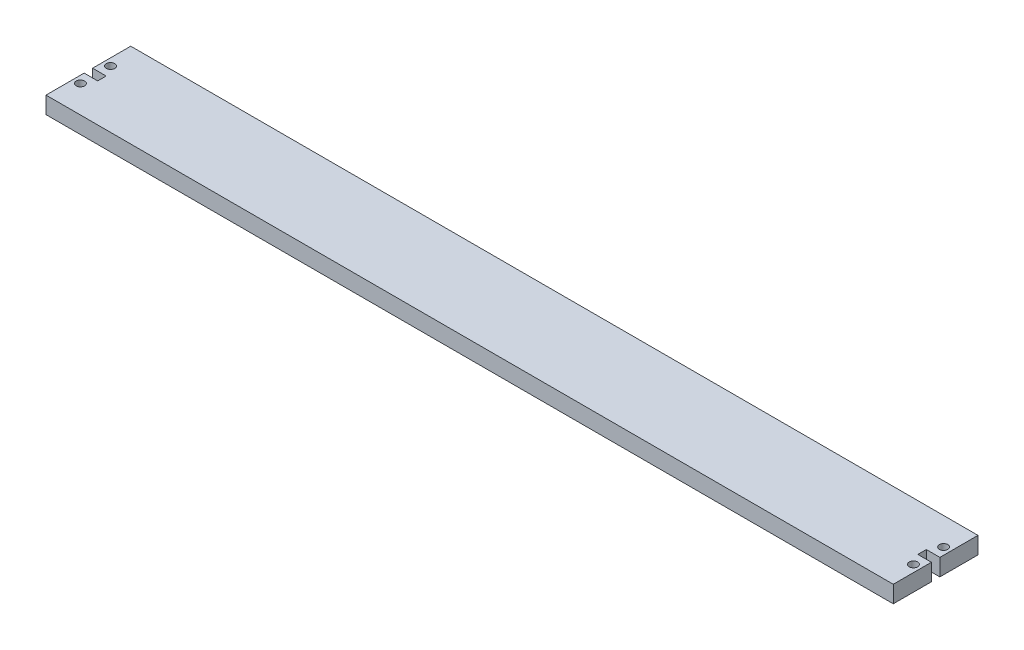
ISO-10303-21;
HEADER;
FILE_DESCRIPTION(('STEP AP214'),'2;1');
FILE_NAME('part.step','',(''),(''),'','','');
FILE_SCHEMA(('AUTOMOTIVE_DESIGN { 1 0 10303 214 1 1 1 1 }'));
ENDSEC;
DATA;
#1=APPLICATION_CONTEXT('core data for automotive mechanical design processes');
#2=APPLICATION_PROTOCOL_DEFINITION('international standard','automotive_design',2000,#1);
#3=PRODUCT_CONTEXT('',#1,'mechanical');
#4=PRODUCT('Part','Part','',(#3));
#5=PRODUCT_RELATED_PRODUCT_CATEGORY('part','',(#4));
#6=PRODUCT_DEFINITION_FORMATION('','',#4);
#7=PRODUCT_DEFINITION_CONTEXT('part definition',#1,'design');
#8=PRODUCT_DEFINITION('design','',#6,#7);
#9=PRODUCT_DEFINITION_SHAPE('','',#8);
#10=(LENGTH_UNIT() NAMED_UNIT(*) SI_UNIT(.MILLI.,.METRE.));
#11=(NAMED_UNIT(*) PLANE_ANGLE_UNIT() SI_UNIT($,.RADIAN.));
#12=(NAMED_UNIT(*) SI_UNIT($,.STERADIAN.) SOLID_ANGLE_UNIT());
#13=UNCERTAINTY_MEASURE_WITH_UNIT(LENGTH_MEASURE(1.E-05),#10,'distance_accuracy_value','');
#14=(GEOMETRIC_REPRESENTATION_CONTEXT(3) GLOBAL_UNCERTAINTY_ASSIGNED_CONTEXT((#13)) GLOBAL_UNIT_ASSIGNED_CONTEXT((#10,
#11,#12)) REPRESENTATION_CONTEXT('',''));
#15=CARTESIAN_POINT('',(0.,0.,0.));
#16=DIRECTION('',(0.,0.,1.));
#17=DIRECTION('',(1.,0.,0.));
#18=AXIS2_PLACEMENT_3D('',#15,#16,#17);
#19=CARTESIAN_POINT('',(500.,10.,0.));
#20=DIRECTION('',(-1.,0.,0.));
#21=DIRECTION('',(0.,0.,1.));
#22=AXIS2_PLACEMENT_3D('',#19,#20,#21);
#23=PLANE('',#22);
#24=DIRECTION('',(0.,0.,-1.));
#25=VECTOR('',#24,1.);
#26=CARTESIAN_POINT('',(500.,0.,0.));
#27=LINE('',#26,#25);
#28=CARTESIAN_POINT('',(500.,0.,50.));
#29=VERTEX_POINT('',#28);
#30=CARTESIAN_POINT('',(500.,0.,27.5));
#31=VERTEX_POINT('',#30);
#32=EDGE_CURVE('E139',#29,#31,#27,.T.);
#33=ORIENTED_EDGE('',*,*,#32,.T.);
#34=DIRECTION('',(0.,1.,0.));
#35=VECTOR('',#34,1.);
#36=CARTESIAN_POINT('',(500.,0.,27.5));
#37=LINE('',#36,#35);
#38=CARTESIAN_POINT('',(500.,10.,27.5));
#39=VERTEX_POINT('',#38);
#40=EDGE_CURVE('E123',#31,#39,#37,.T.);
#41=ORIENTED_EDGE('',*,*,#40,.T.);
#42=DIRECTION('',(0.,0.,-1.));
#43=VECTOR('',#42,1.);
#44=CARTESIAN_POINT('',(500.,10.,0.));
#45=LINE('',#44,#43);
#46=CARTESIAN_POINT('',(500.,10.,50.));
#47=VERTEX_POINT('',#46);
#48=EDGE_CURVE('E182',#47,#39,#45,.T.);
#49=ORIENTED_EDGE('',*,*,#48,.F.);
#50=DIRECTION('',(0.,-1.,0.));
#51=VECTOR('',#50,1.);
#52=CARTESIAN_POINT('',(500.,10.,50.));
#53=LINE('',#52,#51);
#54=EDGE_CURVE('E42',#47,#29,#53,.T.);
#55=ORIENTED_EDGE('',*,*,#54,.T.);
#56=EDGE_LOOP('',(#33,#41,#49,#55));
#57=FACE_BOUND('',#56,.T.);
#58=ADVANCED_FACE('F34',(#57),#23,.F.);
#59=CARTESIAN_POINT('',(0.,10.,0.));
#60=DIRECTION('',(1.,0.,0.));
#61=DIRECTION('',(0.,0.,-1.));
#62=AXIS2_PLACEMENT_3D('',#59,#60,#61);
#63=PLANE('',#62);
#64=DIRECTION('',(0.,0.,1.));
#65=VECTOR('',#64,1.);
#66=CARTESIAN_POINT('',(0.,0.,0.));
#67=LINE('',#66,#65);
#68=CARTESIAN_POINT('',(0.,0.,0.));
#69=VERTEX_POINT('',#68);
#70=CARTESIAN_POINT('',(0.,0.,22.5));
#71=VERTEX_POINT('',#70);
#72=EDGE_CURVE('E173',#69,#71,#67,.T.);
#73=ORIENTED_EDGE('',*,*,#72,.T.);
#74=DIRECTION('',(0.,1.,0.));
#75=VECTOR('',#74,1.);
#76=CARTESIAN_POINT('',(0.,0.,22.5));
#77=LINE('',#76,#75);
#78=CARTESIAN_POINT('',(0.,10.,22.5));
#79=VERTEX_POINT('',#78);
#80=EDGE_CURVE('E193',#71,#79,#77,.T.);
#81=ORIENTED_EDGE('',*,*,#80,.T.);
#82=DIRECTION('',(0.,0.,1.));
#83=VECTOR('',#82,1.);
#84=CARTESIAN_POINT('',(0.,10.,0.));
#85=LINE('',#84,#83);
#86=CARTESIAN_POINT('',(0.,10.,0.));
#87=VERTEX_POINT('',#86);
#88=EDGE_CURVE('E187',#87,#79,#85,.T.);
#89=ORIENTED_EDGE('',*,*,#88,.F.);
#90=DIRECTION('',(0.,-1.,0.));
#91=VECTOR('',#90,1.);
#92=CARTESIAN_POINT('',(0.,10.,0.));
#93=LINE('',#92,#91);
#94=EDGE_CURVE('E155',#87,#69,#93,.T.);
#95=ORIENTED_EDGE('',*,*,#94,.T.);
#96=EDGE_LOOP('',(#73,#81,#89,#95));
#97=FACE_BOUND('',#96,.T.);
#98=ADVANCED_FACE('F266',(#97),#63,.F.);
#99=CARTESIAN_POINT('',(0.,10.,27.5));
#100=VERTEX_POINT('',#99);
#101=CARTESIAN_POINT('',(0.,10.,50.));
#102=VERTEX_POINT('',#101);
#103=EDGE_CURVE('E149',#100,#102,#85,.T.);
#104=ORIENTED_EDGE('',*,*,#103,.F.);
#105=DIRECTION('',(0.,1.,0.));
#106=VECTOR('',#105,1.);
#107=CARTESIAN_POINT('',(0.,0.,27.5));
#108=LINE('',#107,#106);
#109=CARTESIAN_POINT('',(0.,0.,27.5));
#110=VERTEX_POINT('',#109);
#111=EDGE_CURVE('E196',#110,#100,#108,.T.);
#112=ORIENTED_EDGE('',*,*,#111,.F.);
#113=CARTESIAN_POINT('',(0.,0.,50.));
#114=VERTEX_POINT('',#113);
#115=EDGE_CURVE('E178',#110,#114,#67,.T.);
#116=ORIENTED_EDGE('',*,*,#115,.T.);
#117=DIRECTION('',(0.,-1.,0.));
#118=VECTOR('',#117,1.);
#119=CARTESIAN_POINT('',(0.,10.,50.));
#120=LINE('',#119,#118);
#121=EDGE_CURVE('E11',#102,#114,#120,.T.);
#122=ORIENTED_EDGE('',*,*,#121,.F.);
#123=EDGE_LOOP('',(#104,#112,#116,#122));
#124=FACE_BOUND('',#123,.T.);
#125=ADVANCED_FACE('F36',(#124),#63,.F.);
#126=CARTESIAN_POINT('',(0.,10.,50.));
#127=DIRECTION('',(0.,0.,-1.));
#128=DIRECTION('',(-1.,0.,0.));
#129=AXIS2_PLACEMENT_3D('',#126,#127,#128);
#130=PLANE('',#129);
#131=DIRECTION('',(1.,0.,0.));
#132=VECTOR('',#131,1.);
#133=CARTESIAN_POINT('',(0.,0.,50.));
#134=LINE('',#133,#132);
#135=EDGE_CURVE('E151',#114,#29,#134,.T.);
#136=ORIENTED_EDGE('',*,*,#135,.T.);
#137=ORIENTED_EDGE('',*,*,#54,.F.);
#138=DIRECTION('',(1.,0.,0.));
#139=VECTOR('',#138,1.);
#140=CARTESIAN_POINT('',(0.,10.,50.));
#141=LINE('',#140,#139);
#142=EDGE_CURVE('E185',#102,#47,#141,.T.);
#143=ORIENTED_EDGE('',*,*,#142,.F.);
#144=ORIENTED_EDGE('',*,*,#121,.T.);
#145=EDGE_LOOP('',(#136,#137,#143,#144));
#146=FACE_BOUND('',#145,.T.);
#147=ADVANCED_FACE('F273',(#146),#130,.F.);
#148=CARTESIAN_POINT('',(500.,10.,22.5));
#149=VERTEX_POINT('',#148);
#150=CARTESIAN_POINT('',(500.,10.,0.));
#151=VERTEX_POINT('',#150);
#152=EDGE_CURVE('E184',#149,#151,#45,.T.);
#153=ORIENTED_EDGE('',*,*,#152,.F.);
#154=DIRECTION('',(0.,1.,0.));
#155=VECTOR('',#154,1.);
#156=CARTESIAN_POINT('',(500.,0.,22.5));
#157=LINE('',#156,#155);
#158=CARTESIAN_POINT('',(500.,0.,22.5));
#159=VERTEX_POINT('',#158);
#160=EDGE_CURVE('E133',#159,#149,#157,.T.);
#161=ORIENTED_EDGE('',*,*,#160,.F.);
#162=CARTESIAN_POINT('',(500.,0.,0.));
#163=VERTEX_POINT('',#162);
#164=EDGE_CURVE('E147',#159,#163,#27,.T.);
#165=ORIENTED_EDGE('',*,*,#164,.T.);
#166=DIRECTION('',(0.,-1.,0.));
#167=VECTOR('',#166,1.);
#168=CARTESIAN_POINT('',(500.,10.,0.));
#169=LINE('',#168,#167);
#170=EDGE_CURVE('E158',#151,#163,#169,.T.);
#171=ORIENTED_EDGE('',*,*,#170,.F.);
#172=EDGE_LOOP('',(#153,#161,#165,#171));
#173=FACE_BOUND('',#172,.T.);
#174=ADVANCED_FACE('F250',(#173),#23,.F.);
#175=CARTESIAN_POINT('',(0.,10.,0.));
#176=DIRECTION('',(0.,0.,1.));
#177=DIRECTION('',(1.,0.,0.));
#178=AXIS2_PLACEMENT_3D('',#175,#176,#177);
#179=PLANE('',#178);
#180=DIRECTION('',(-1.,0.,0.));
#181=VECTOR('',#180,1.);
#182=CARTESIAN_POINT('',(0.,0.,0.));
#183=LINE('',#182,#181);
#184=EDGE_CURVE('E146',#163,#69,#183,.T.);
#185=ORIENTED_EDGE('',*,*,#184,.T.);
#186=ORIENTED_EDGE('',*,*,#94,.F.);
#187=DIRECTION('',(-1.,0.,0.));
#188=VECTOR('',#187,1.);
#189=CARTESIAN_POINT('',(0.,10.,0.));
#190=LINE('',#189,#188);
#191=EDGE_CURVE('E159',#151,#87,#190,.T.);
#192=ORIENTED_EDGE('',*,*,#191,.F.);
#193=ORIENTED_EDGE('',*,*,#170,.T.);
#194=EDGE_LOOP('',(#185,#186,#192,#193));
#195=FACE_BOUND('',#194,.T.);
#196=ADVANCED_FACE('F165',(#195),#179,.F.);
#197=CARTESIAN_POINT('',(0.,10.,0.));
#198=DIRECTION('',(0.,1.,0.));
#199=DIRECTION('',(0.,0.,1.));
#200=AXIS2_PLACEMENT_3D('',#197,#198,#199);
#201=PLANE('',#200);
#202=DIRECTION('',(1.,0.,0.));
#203=VECTOR('',#202,1.);
#204=CARTESIAN_POINT('',(492.,10.,27.5));
#205=LINE('',#204,#203);
#206=CARTESIAN_POINT('',(492.,10.,27.5));
#207=VERTEX_POINT('',#206);
#208=EDGE_CURVE('E128',#207,#39,#205,.T.);
#209=ORIENTED_EDGE('',*,*,#208,.F.);
#210=DIRECTION('',(0.,0.,1.));
#211=VECTOR('',#210,1.);
#212=CARTESIAN_POINT('',(492.,10.,22.5));
#213=LINE('',#212,#211);
#214=CARTESIAN_POINT('',(492.,10.,22.5));
#215=VERTEX_POINT('',#214);
#216=EDGE_CURVE('E142',#215,#207,#213,.T.);
#217=ORIENTED_EDGE('',*,*,#216,.F.);
#218=DIRECTION('',(-1.,0.,0.));
#219=VECTOR('',#218,1.);
#220=CARTESIAN_POINT('',(500.,10.,22.5));
#221=LINE('',#220,#219);
#222=EDGE_CURVE('E241',#149,#215,#221,.T.);
#223=ORIENTED_EDGE('',*,*,#222,.F.);
#224=ORIENTED_EDGE('',*,*,#152,.T.);
#225=ORIENTED_EDGE('',*,*,#191,.T.);
#226=ORIENTED_EDGE('',*,*,#88,.T.);
#227=DIRECTION('',(-1.,0.,0.));
#228=VECTOR('',#227,1.);
#229=CARTESIAN_POINT('',(0.,10.,22.5));
#230=LINE('',#229,#228);
#231=CARTESIAN_POINT('',(8.,10.,22.5));
#232=VERTEX_POINT('',#231);
#233=EDGE_CURVE('E203',#232,#79,#230,.T.);
#234=ORIENTED_EDGE('',*,*,#233,.F.);
#235=DIRECTION('',(0.,0.,-1.));
#236=VECTOR('',#235,1.);
#237=CARTESIAN_POINT('',(8.,10.,22.5));
#238=LINE('',#237,#236);
#239=CARTESIAN_POINT('',(8.,10.,27.5));
#240=VERTEX_POINT('',#239);
#241=EDGE_CURVE('E206',#240,#232,#238,.T.);
#242=ORIENTED_EDGE('',*,*,#241,.F.);
#243=DIRECTION('',(1.,0.,0.));
#244=VECTOR('',#243,1.);
#245=CARTESIAN_POINT('',(8.,10.,27.5));
#246=LINE('',#245,#244);
#247=EDGE_CURVE('E209',#100,#240,#246,.T.);
#248=ORIENTED_EDGE('',*,*,#247,.F.);
#249=ORIENTED_EDGE('',*,*,#103,.T.);
#250=ORIENTED_EDGE('',*,*,#142,.T.);
#251=ORIENTED_EDGE('',*,*,#48,.T.);
#252=EDGE_LOOP('',(#209,#217,#223,#224,#225,#226,#234,#242,#248,#249,#250,#251));
#253=FACE_BOUND('',#252,.T.);
#254=CARTESIAN_POINT('',(495.8,10.,16.1));
#255=DIRECTION('',(0.,1.,0.));
#256=DIRECTION('',(0.,0.,-1.));
#257=AXIS2_PLACEMENT_3D('',#254,#255,#256);
#258=CIRCLE('',#257,2.49999999999997);
#259=CARTESIAN_POINT('',(495.8,10.,13.6));
#260=VERTEX_POINT('',#259);
#261=EDGE_CURVE('E229',#260,#260,#258,.T.);
#262=ORIENTED_EDGE('',*,*,#261,.F.);
#263=EDGE_LOOP('',(#262));
#264=FACE_BOUND('',#263,.T.);
#265=CARTESIAN_POINT('',(495.8,10.,33.9));
#266=DIRECTION('',(0.,1.,0.));
#267=DIRECTION('',(0.,0.,1.));
#268=AXIS2_PLACEMENT_3D('',#265,#266,#267);
#269=CIRCLE('',#268,2.49999999999997);
#270=CARTESIAN_POINT('',(495.8,10.,36.4));
#271=VERTEX_POINT('',#270);
#272=EDGE_CURVE('E223',#271,#271,#269,.T.);
#273=ORIENTED_EDGE('',*,*,#272,.F.);
#274=EDGE_LOOP('',(#273));
#275=FACE_BOUND('',#274,.T.);
#276=CARTESIAN_POINT('',(4.2,10.,33.9));
#277=DIRECTION('',(0.,1.,0.));
#278=DIRECTION('',(0.,0.,-1.));
#279=AXIS2_PLACEMENT_3D('',#276,#277,#278);
#280=CIRCLE('',#279,2.5);
#281=CARTESIAN_POINT('',(4.2,10.,31.4));
#282=VERTEX_POINT('',#281);
#283=EDGE_CURVE('E217',#282,#282,#280,.T.);
#284=ORIENTED_EDGE('',*,*,#283,.F.);
#285=EDGE_LOOP('',(#284));
#286=FACE_BOUND('',#285,.T.);
#287=CARTESIAN_POINT('',(4.2,10.,16.1));
#288=DIRECTION('',(0.,1.,0.));
#289=DIRECTION('',(0.,0.,1.));
#290=AXIS2_PLACEMENT_3D('',#287,#288,#289);
#291=CIRCLE('',#290,2.5);
#292=CARTESIAN_POINT('',(4.2,10.,18.6));
#293=VERTEX_POINT('',#292);
#294=EDGE_CURVE('E190',#293,#293,#291,.T.);
#295=ORIENTED_EDGE('',*,*,#294,.F.);
#296=EDGE_LOOP('',(#295));
#297=FACE_BOUND('',#296,.T.);
#298=ADVANCED_FACE('F252',(#253,#264,#275,#286,#297),#201,.T.);
#299=CARTESIAN_POINT('',(0.,0.,0.));
#300=DIRECTION('',(0.,1.,0.));
#301=DIRECTION('',(0.,0.,1.));
#302=AXIS2_PLACEMENT_3D('',#299,#300,#301);
#303=PLANE('',#302);
#304=CARTESIAN_POINT('',(495.8,0.,16.1));
#305=DIRECTION('',(0.,1.,0.));
#306=DIRECTION('',(0.,0.,-1.));
#307=AXIS2_PLACEMENT_3D('',#304,#305,#306);
#308=CIRCLE('',#307,2.49999999999997);
#309=CARTESIAN_POINT('',(495.8,0.,13.6));
#310=VERTEX_POINT('',#309);
#311=EDGE_CURVE('E226',#310,#310,#308,.T.);
#312=ORIENTED_EDGE('',*,*,#311,.T.);
#313=EDGE_LOOP('',(#312));
#314=FACE_BOUND('',#313,.T.);
#315=CARTESIAN_POINT('',(495.8,0.,33.9));
#316=DIRECTION('',(0.,1.,0.));
#317=DIRECTION('',(0.,0.,1.));
#318=AXIS2_PLACEMENT_3D('',#315,#316,#317);
#319=CIRCLE('',#318,2.49999999999997);
#320=CARTESIAN_POINT('',(495.8,0.,36.4));
#321=VERTEX_POINT('',#320);
#322=EDGE_CURVE('E220',#321,#321,#319,.T.);
#323=ORIENTED_EDGE('',*,*,#322,.T.);
#324=EDGE_LOOP('',(#323));
#325=FACE_BOUND('',#324,.T.);
#326=CARTESIAN_POINT('',(4.2,0.,33.9));
#327=DIRECTION('',(0.,1.,0.));
#328=DIRECTION('',(0.,0.,-1.));
#329=AXIS2_PLACEMENT_3D('',#326,#327,#328);
#330=CIRCLE('',#329,2.5);
#331=CARTESIAN_POINT('',(4.2,0.,31.4));
#332=VERTEX_POINT('',#331);
#333=EDGE_CURVE('E212',#332,#332,#330,.T.);
#334=ORIENTED_EDGE('',*,*,#333,.T.);
#335=EDGE_LOOP('',(#334));
#336=FACE_BOUND('',#335,.T.);
#337=CARTESIAN_POINT('',(4.2,0.,16.1));
#338=DIRECTION('',(0.,1.,0.));
#339=DIRECTION('',(0.,0.,1.));
#340=AXIS2_PLACEMENT_3D('',#337,#338,#339);
#341=CIRCLE('',#340,2.5);
#342=CARTESIAN_POINT('',(4.2,0.,18.6));
#343=VERTEX_POINT('',#342);
#344=EDGE_CURVE('E179',#343,#343,#341,.T.);
#345=ORIENTED_EDGE('',*,*,#344,.T.);
#346=EDGE_LOOP('',(#345));
#347=FACE_BOUND('',#346,.T.);
#348=DIRECTION('',(0.,0.,1.));
#349=VECTOR('',#348,1.);
#350=CARTESIAN_POINT('',(492.,0.,22.5));
#351=LINE('',#350,#349);
#352=CARTESIAN_POINT('',(492.,0.,22.5));
#353=VERTEX_POINT('',#352);
#354=CARTESIAN_POINT('',(492.,0.,27.5));
#355=VERTEX_POINT('',#354);
#356=EDGE_CURVE('E49',#353,#355,#351,.T.);
#357=ORIENTED_EDGE('',*,*,#356,.T.);
#358=DIRECTION('',(1.,0.,0.));
#359=VECTOR('',#358,1.);
#360=CARTESIAN_POINT('',(492.,0.,27.5));
#361=LINE('',#360,#359);
#362=EDGE_CURVE('E126',#355,#31,#361,.T.);
#363=ORIENTED_EDGE('',*,*,#362,.T.);
#364=ORIENTED_EDGE('',*,*,#32,.F.);
#365=ORIENTED_EDGE('',*,*,#135,.F.);
#366=ORIENTED_EDGE('',*,*,#115,.F.);
#367=DIRECTION('',(1.,0.,0.));
#368=VECTOR('',#367,1.);
#369=CARTESIAN_POINT('',(8.,0.,27.5));
#370=LINE('',#369,#368);
#371=CARTESIAN_POINT('',(8.,0.,27.5));
#372=VERTEX_POINT('',#371);
#373=EDGE_CURVE('E205',#110,#372,#370,.T.);
#374=ORIENTED_EDGE('',*,*,#373,.T.);
#375=DIRECTION('',(0.,0.,-1.));
#376=VECTOR('',#375,1.);
#377=CARTESIAN_POINT('',(8.,0.,22.5));
#378=LINE('',#377,#376);
#379=CARTESIAN_POINT('',(8.,0.,22.5));
#380=VERTEX_POINT('',#379);
#381=EDGE_CURVE('E57',#372,#380,#378,.T.);
#382=ORIENTED_EDGE('',*,*,#381,.T.);
#383=DIRECTION('',(-1.,0.,0.));
#384=VECTOR('',#383,1.);
#385=CARTESIAN_POINT('',(0.,0.,22.5));
#386=LINE('',#385,#384);
#387=EDGE_CURVE('E175',#380,#71,#386,.T.);
#388=ORIENTED_EDGE('',*,*,#387,.T.);
#389=ORIENTED_EDGE('',*,*,#72,.F.);
#390=ORIENTED_EDGE('',*,*,#184,.F.);
#391=ORIENTED_EDGE('',*,*,#164,.F.);
#392=DIRECTION('',(-1.,0.,0.));
#393=VECTOR('',#392,1.);
#394=CARTESIAN_POINT('',(500.,0.,22.5));
#395=LINE('',#394,#393);
#396=EDGE_CURVE('E141',#159,#353,#395,.T.);
#397=ORIENTED_EDGE('',*,*,#396,.T.);
#398=EDGE_LOOP('',(#357,#363,#364,#365,#366,#374,#382,#388,#389,#390,#391,#397));
#399=FACE_BOUND('',#398,.T.);
#400=ADVANCED_FACE('F137',(#314,#325,#336,#347,#399),#303,.F.);
#401=CARTESIAN_POINT('',(4.2,0.,16.1));
#402=DIRECTION('',(0.,1.,0.));
#403=DIRECTION('',(0.,0.,1.));
#404=AXIS2_PLACEMENT_3D('',#401,#402,#403);
#405=CYLINDRICAL_SURFACE('',#404,2.5);
#406=ORIENTED_EDGE('',*,*,#344,.F.);
#407=EDGE_LOOP('',(#406));
#408=FACE_BOUND('',#407,.T.);
#409=ORIENTED_EDGE('',*,*,#294,.T.);
#410=EDGE_LOOP('',(#409));
#411=FACE_BOUND('',#410,.T.);
#412=ADVANCED_FACE('F298',(#408,#411),#405,.F.);
#413=CARTESIAN_POINT('',(0.,0.,22.5));
#414=DIRECTION('',(0.,0.,-1.));
#415=DIRECTION('',(-1.,0.,0.));
#416=AXIS2_PLACEMENT_3D('',#413,#414,#415);
#417=PLANE('',#416);
#418=ORIENTED_EDGE('',*,*,#233,.T.);
#419=ORIENTED_EDGE('',*,*,#80,.F.);
#420=ORIENTED_EDGE('',*,*,#387,.F.);
#421=DIRECTION('',(0.,1.,0.));
#422=VECTOR('',#421,1.);
#423=CARTESIAN_POINT('',(8.,0.,22.5));
#424=LINE('',#423,#422);
#425=EDGE_CURVE('E200',#380,#232,#424,.T.);
#426=ORIENTED_EDGE('',*,*,#425,.T.);
#427=EDGE_LOOP('',(#418,#419,#420,#426));
#428=FACE_BOUND('',#427,.T.);
#429=ADVANCED_FACE('F295',(#428),#417,.F.);
#430=CARTESIAN_POINT('',(8.,0.,22.5));
#431=DIRECTION('',(1.,0.,0.));
#432=DIRECTION('',(0.,0.,-1.));
#433=AXIS2_PLACEMENT_3D('',#430,#431,#432);
#434=PLANE('',#433);
#435=ORIENTED_EDGE('',*,*,#241,.T.);
#436=ORIENTED_EDGE('',*,*,#425,.F.);
#437=ORIENTED_EDGE('',*,*,#381,.F.);
#438=DIRECTION('',(0.,1.,0.));
#439=VECTOR('',#438,1.);
#440=CARTESIAN_POINT('',(8.,0.,27.5));
#441=LINE('',#440,#439);
#442=EDGE_CURVE('E198',#372,#240,#441,.T.);
#443=ORIENTED_EDGE('',*,*,#442,.T.);
#444=EDGE_LOOP('',(#435,#436,#437,#443));
#445=FACE_BOUND('',#444,.T.);
#446=ADVANCED_FACE('F293',(#445),#434,.F.);
#447=CARTESIAN_POINT('',(8.,0.,27.5));
#448=DIRECTION('',(0.,0.,1.));
#449=DIRECTION('',(1.,0.,0.));
#450=AXIS2_PLACEMENT_3D('',#447,#448,#449);
#451=PLANE('',#450);
#452=ORIENTED_EDGE('',*,*,#247,.T.);
#453=ORIENTED_EDGE('',*,*,#442,.F.);
#454=ORIENTED_EDGE('',*,*,#373,.F.);
#455=ORIENTED_EDGE('',*,*,#111,.T.);
#456=EDGE_LOOP('',(#452,#453,#454,#455));
#457=FACE_BOUND('',#456,.T.);
#458=ADVANCED_FACE('F290',(#457),#451,.F.);
#459=CARTESIAN_POINT('',(4.2,0.,33.9));
#460=DIRECTION('',(0.,1.,0.));
#461=DIRECTION('',(0.,0.,1.));
#462=AXIS2_PLACEMENT_3D('',#459,#460,#461);
#463=CYLINDRICAL_SURFACE('',#462,2.5);
#464=ORIENTED_EDGE('',*,*,#333,.F.);
#465=EDGE_LOOP('',(#464));
#466=FACE_BOUND('',#465,.T.);
#467=ORIENTED_EDGE('',*,*,#283,.T.);
#468=EDGE_LOOP('',(#467));
#469=FACE_BOUND('',#468,.T.);
#470=ADVANCED_FACE('F308',(#466,#469),#463,.F.);
#471=CARTESIAN_POINT('',(495.8,0.,33.9));
#472=DIRECTION('',(0.,1.,0.));
#473=DIRECTION('',(0.,0.,1.));
#474=AXIS2_PLACEMENT_3D('',#471,#472,#473);
#475=CYLINDRICAL_SURFACE('',#474,2.49999999999997);
#476=ORIENTED_EDGE('',*,*,#322,.F.);
#477=EDGE_LOOP('',(#476));
#478=FACE_BOUND('',#477,.T.);
#479=ORIENTED_EDGE('',*,*,#272,.T.);
#480=EDGE_LOOP('',(#479));
#481=FACE_BOUND('',#480,.T.);
#482=ADVANCED_FACE('F332',(#478,#481),#475,.F.);
#483=CARTESIAN_POINT('',(495.8,0.,16.1));
#484=DIRECTION('',(0.,1.,0.));
#485=DIRECTION('',(0.,0.,1.));
#486=AXIS2_PLACEMENT_3D('',#483,#484,#485);
#487=CYLINDRICAL_SURFACE('',#486,2.49999999999997);
#488=ORIENTED_EDGE('',*,*,#311,.F.);
#489=EDGE_LOOP('',(#488));
#490=FACE_BOUND('',#489,.T.);
#491=ORIENTED_EDGE('',*,*,#261,.T.);
#492=EDGE_LOOP('',(#491));
#493=FACE_BOUND('',#492,.T.);
#494=ADVANCED_FACE('F263',(#490,#493),#487,.F.);
#495=CARTESIAN_POINT('',(492.,0.,27.5));
#496=DIRECTION('',(0.,0.,1.));
#497=DIRECTION('',(1.,0.,0.));
#498=AXIS2_PLACEMENT_3D('',#495,#496,#497);
#499=PLANE('',#498);
#500=ORIENTED_EDGE('',*,*,#208,.T.);
#501=ORIENTED_EDGE('',*,*,#40,.F.);
#502=ORIENTED_EDGE('',*,*,#362,.F.);
#503=DIRECTION('',(0.,1.,0.));
#504=VECTOR('',#503,1.);
#505=CARTESIAN_POINT('',(492.,0.,27.5));
#506=LINE('',#505,#504);
#507=EDGE_CURVE('E232',#355,#207,#506,.T.);
#508=ORIENTED_EDGE('',*,*,#507,.T.);
#509=EDGE_LOOP('',(#500,#501,#502,#508));
#510=FACE_BOUND('',#509,.T.);
#511=ADVANCED_FACE('F125',(#510),#499,.F.);
#512=CARTESIAN_POINT('',(492.,0.,22.5));
#513=DIRECTION('',(-1.,0.,0.));
#514=DIRECTION('',(0.,0.,1.));
#515=AXIS2_PLACEMENT_3D('',#512,#513,#514);
#516=PLANE('',#515);
#517=ORIENTED_EDGE('',*,*,#216,.T.);
#518=ORIENTED_EDGE('',*,*,#507,.F.);
#519=ORIENTED_EDGE('',*,*,#356,.F.);
#520=DIRECTION('',(0.,1.,0.));
#521=VECTOR('',#520,1.);
#522=CARTESIAN_POINT('',(492.,0.,22.5));
#523=LINE('',#522,#521);
#524=EDGE_CURVE('E236',#353,#215,#523,.T.);
#525=ORIENTED_EDGE('',*,*,#524,.T.);
#526=EDGE_LOOP('',(#517,#518,#519,#525));
#527=FACE_BOUND('',#526,.T.);
#528=ADVANCED_FACE('F255',(#527),#516,.F.);
#529=CARTESIAN_POINT('',(500.,0.,22.5));
#530=DIRECTION('',(0.,0.,-1.));
#531=DIRECTION('',(-1.,0.,0.));
#532=AXIS2_PLACEMENT_3D('',#529,#530,#531);
#533=PLANE('',#532);
#534=ORIENTED_EDGE('',*,*,#222,.T.);
#535=ORIENTED_EDGE('',*,*,#524,.F.);
#536=ORIENTED_EDGE('',*,*,#396,.F.);
#537=ORIENTED_EDGE('',*,*,#160,.T.);
#538=EDGE_LOOP('',(#534,#535,#536,#537));
#539=FACE_BOUND('',#538,.T.);
#540=ADVANCED_FACE('F248',(#539),#533,.F.);
#541=CLOSED_SHELL('',(#58,#98,#125,#147,#174,#196,#298,#400,#412,#429,#446,#458,#470,#482,#494,
#511,#528,#540));
#542=MANIFOLD_SOLID_BREP('B2',#541);
#543=ADVANCED_BREP_SHAPE_REPRESENTATION('',(#18,#542),#14);
#544=SHAPE_DEFINITION_REPRESENTATION(#9,#543);
ENDSEC;
END-ISO-10303-21;
